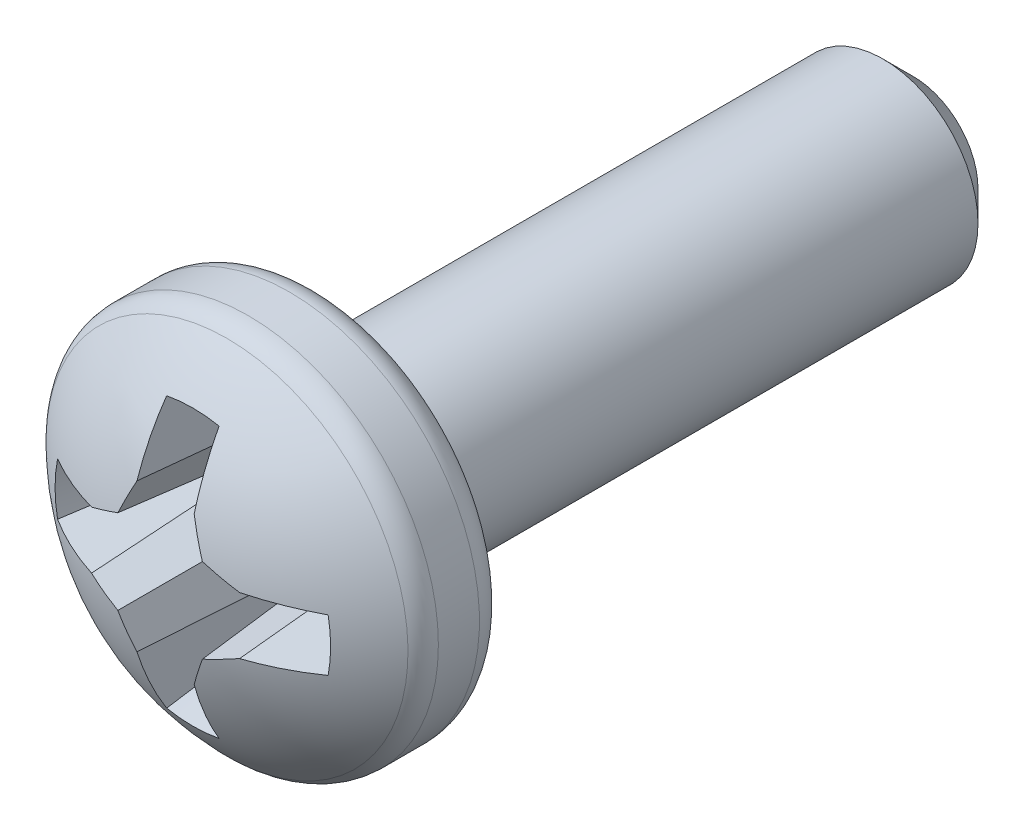
ISO-10303-21;
HEADER;
FILE_DESCRIPTION(('STEP AP214'),'2;1');
FILE_NAME('part.step','',(''),(''),'','','');
FILE_SCHEMA(('AUTOMOTIVE_DESIGN { 1 0 10303 214 1 1 1 1 }'));
ENDSEC;
DATA;
#1=APPLICATION_CONTEXT('core data for automotive mechanical design processes');
#2=APPLICATION_PROTOCOL_DEFINITION('international standard','automotive_design',2000,#1);
#3=PRODUCT_CONTEXT('',#1,'mechanical');
#4=PRODUCT('Part','Part','',(#3));
#5=PRODUCT_RELATED_PRODUCT_CATEGORY('part','',(#4));
#6=PRODUCT_DEFINITION_FORMATION('','',#4);
#7=PRODUCT_DEFINITION_CONTEXT('part definition',#1,'design');
#8=PRODUCT_DEFINITION('design','',#6,#7);
#9=PRODUCT_DEFINITION_SHAPE('','',#8);
#10=(LENGTH_UNIT() NAMED_UNIT(*) SI_UNIT(.MILLI.,.METRE.));
#11=(NAMED_UNIT(*) PLANE_ANGLE_UNIT() SI_UNIT($,.RADIAN.));
#12=(NAMED_UNIT(*) SI_UNIT($,.STERADIAN.) SOLID_ANGLE_UNIT());
#13=UNCERTAINTY_MEASURE_WITH_UNIT(LENGTH_MEASURE(1.E-05),#10,'distance_accuracy_value','');
#14=(GEOMETRIC_REPRESENTATION_CONTEXT(3) GLOBAL_UNCERTAINTY_ASSIGNED_CONTEXT((#13)) GLOBAL_UNIT_ASSIGNED_CONTEXT((#10,
#11,#12)) REPRESENTATION_CONTEXT('',''));
#15=CARTESIAN_POINT('',(0.,0.,0.));
#16=DIRECTION('',(0.,0.,1.));
#17=DIRECTION('',(1.,0.,0.));
#18=AXIS2_PLACEMENT_3D('',#15,#16,#17);
#19=CARTESIAN_POINT('',(-0.376721674615797,0.791461441644268,0.413196607862429));
#20=DIRECTION('',(0.,0.,1.));
#21=DIRECTION('',(1.,0.,0.));
#22=AXIS2_PLACEMENT_3D('',#19,#20,#21);
#23=PLANE('',#22);
#24=DIRECTION('',(0.382683432365081,-0.92387953251129,0.));
#25=VECTOR('',#24,1.);
#26=CARTESIAN_POINT('',(-0.363407787845929,0.796976234112247,0.413196607862429));
#27=LINE('',#26,#25);
#28=CARTESIAN_POINT('',(-0.370978033261302,0.815252423264536,0.413196607862429));
#29=VERTEX_POINT('',#28);
#30=CARTESIAN_POINT('',(-0.365692089679838,0.802491026580226,0.413196607862429));
#31=VERTEX_POINT('',#30);
#32=EDGE_CURVE('E292',#29,#31,#27,.T.);
#33=ORIENTED_EDGE('',*,*,#32,.F.);
#34=DIRECTION('',(0.,1.,0.));
#35=VECTOR('',#34,1.);
#36=CARTESIAN_POINT('',(-0.370978033261302,0.791461441644268,0.413196607862429));
#37=LINE('',#36,#35);
#38=CARTESIAN_POINT('',(-0.370978033261302,0.827667770301122,0.413196607862429));
#39=VERTEX_POINT('',#38);
#40=EDGE_CURVE('E168',#39,#29,#37,.F.);
#41=ORIENTED_EDGE('',*,*,#40,.F.);
#42=CARTESIAN_POINT('',(-0.376721674615797,0.791461441644268,0.413196607862429));
#43=DIRECTION('',(0.,0.,1.));
#44=DIRECTION('',(1.,0.,0.));
#45=AXIS2_PLACEMENT_3D('',#42,#43,#44);
#46=CIRCLE('',#45,0.0366590732400206);
#47=CARTESIAN_POINT('',(-0.382465315970288,0.827667770301123,0.413196607862429));
#48=VERTEX_POINT('',#47);
#49=EDGE_CURVE('E159',#39,#48,#46,.T.);
#50=ORIENTED_EDGE('',*,*,#49,.T.);
#51=DIRECTION('',(0.,1.,0.));
#52=VECTOR('',#51,1.);
#53=CARTESIAN_POINT('',(-0.382465315970287,0.791461441644271,0.413196607862429));
#54=LINE('',#53,#52);
#55=CARTESIAN_POINT('',(-0.382465315970288,0.815252423264539,0.413196607862429));
#56=VERTEX_POINT('',#55);
#57=EDGE_CURVE('E166',#56,#48,#54,.T.);
#58=ORIENTED_EDGE('',*,*,#57,.F.);
#59=DIRECTION('',(0.382683432365079,0.923879532511291,0.));
#60=VECTOR('',#59,1.);
#61=CARTESIAN_POINT('',(-0.390035561385662,0.79697623411225,0.413196607862429));
#62=LINE('',#61,#60);
#63=CARTESIAN_POINT('',(-0.387751259551752,0.802491026580229,0.413196607862429));
#64=VERTEX_POINT('',#63);
#65=EDGE_CURVE('E301',#64,#56,#62,.T.);
#66=ORIENTED_EDGE('',*,*,#65,.F.);
#67=DIRECTION('',(0.923879532511289,0.382683432365086,0.));
#68=VECTOR('',#67,1.);
#69=CARTESIAN_POINT('',(-0.382236467083772,0.804775328414139,0.413196607862429));
#70=LINE('',#69,#68);
#71=CARTESIAN_POINT('',(-0.400512656236062,0.797205082998765,0.413196607862429));
#72=VERTEX_POINT('',#71);
#73=EDGE_CURVE('E307',#72,#64,#70,.T.);
#74=ORIENTED_EDGE('',*,*,#73,.F.);
#75=DIRECTION('',(1.,0.,0.));
#76=VECTOR('',#75,1.);
#77=CARTESIAN_POINT('',(-0.376721674615793,0.797205082998765,0.413196607862429));
#78=LINE('',#77,#76);
#79=CARTESIAN_POINT('',(-0.412928003323473,0.797205082997996,0.413196607853642));
#80=VERTEX_POINT('',#79);
#81=EDGE_CURVE('E313',#80,#72,#78,.T.);
#82=ORIENTED_EDGE('',*,*,#81,.F.);
#83=CARTESIAN_POINT('',(-0.376721674615794,0.791461441644271,0.413196607862429));
#84=DIRECTION('',(0.,0.,1.));
#85=DIRECTION('',(1.,0.,0.));
#86=AXIS2_PLACEMENT_3D('',#83,#84,#85);
#87=CIRCLE('',#86,0.0366590732924525);
#88=CARTESIAN_POINT('',(-0.412928003325736,0.78571780028978,0.413196607862429));
#89=VERTEX_POINT('',#88);
#90=EDGE_CURVE('E410',#80,#89,#87,.T.);
#91=ORIENTED_EDGE('',*,*,#90,.T.);
#92=DIRECTION('',(1.,0.,0.));
#93=VECTOR('',#92,1.);
#94=CARTESIAN_POINT('',(-0.376721674615797,0.78571780028978,0.413196607862429));
#95=LINE('',#94,#93);
#96=CARTESIAN_POINT('',(-0.400512656236065,0.78571780028978,0.413196607862429));
#97=VERTEX_POINT('',#96);
#98=EDGE_CURVE('E247',#97,#89,#95,.F.);
#99=ORIENTED_EDGE('',*,*,#98,.F.);
#100=DIRECTION('',(-0.923879532511292,0.382683432365076,0.));
#101=VECTOR('',#100,1.);
#102=CARTESIAN_POINT('',(-0.382236467083776,0.778147554874406,0.413196607862429));
#103=LINE('',#102,#101);
#104=CARTESIAN_POINT('',(-0.387751259551755,0.780431856708316,0.413196607862429));
#105=VERTEX_POINT('',#104);
#106=EDGE_CURVE('E248',#105,#97,#103,.T.);
#107=ORIENTED_EDGE('',*,*,#106,.F.);
#108=DIRECTION('',(-0.38268343236509,0.923879532511287,0.));
#109=VECTOR('',#108,1.);
#110=CARTESIAN_POINT('',(-0.390035561385666,0.785946649176296,0.413196607862429));
#111=LINE('',#110,#109);
#112=CARTESIAN_POINT('',(-0.382465315970291,0.767670460024005,0.413196607862429));
#113=VERTEX_POINT('',#112);
#114=EDGE_CURVE('E254',#113,#105,#111,.T.);
#115=ORIENTED_EDGE('',*,*,#114,.F.);
#116=DIRECTION('',(0.,1.,0.));
#117=VECTOR('',#116,1.);
#118=CARTESIAN_POINT('',(-0.382465315970291,0.791461441644275,0.413196607862429));
#119=LINE('',#118,#117);
#120=CARTESIAN_POINT('',(-0.38246531597029,0.755255112943223,0.413196607862429));
#121=VERTEX_POINT('',#120);
#122=EDGE_CURVE('E260',#121,#113,#119,.T.);
#123=ORIENTED_EDGE('',*,*,#122,.F.);
#124=CARTESIAN_POINT('',(-0.376721674615796,0.791461441644275,0.413196607862429));
#125=DIRECTION('',(0.,0.,1.));
#126=DIRECTION('',(1.,0.,0.));
#127=AXIS2_PLACEMENT_3D('',#124,#125,#126);
#128=CIRCLE('',#127,0.036659073283672);
#129=CARTESIAN_POINT('',(-0.370978033261305,0.755255112943223,0.413196607862429));
#130=VERTEX_POINT('',#129);
#131=EDGE_CURVE('E336',#121,#130,#128,.T.);
#132=ORIENTED_EDGE('',*,*,#131,.T.);
#133=DIRECTION('',(0.,1.,0.));
#134=VECTOR('',#133,1.);
#135=CARTESIAN_POINT('',(-0.370978033261306,0.791461441644272,0.413196607862429));
#136=LINE('',#135,#134);
#137=CARTESIAN_POINT('',(-0.370978033261305,0.767670460024002,0.413196607862429));
#138=VERTEX_POINT('',#137);
#139=EDGE_CURVE('E266',#138,#130,#136,.F.);
#140=ORIENTED_EDGE('',*,*,#139,.F.);
#141=DIRECTION('',(-0.382683432365075,-0.923879532511293,0.));
#142=VECTOR('',#141,1.);
#143=CARTESIAN_POINT('',(-0.363407787845931,0.785946649176293,0.413196607862429));
#144=LINE('',#143,#142);
#145=CARTESIAN_POINT('',(-0.365692089679841,0.780431856708313,0.413196607862429));
#146=VERTEX_POINT('',#145);
#147=EDGE_CURVE('E267',#146,#138,#144,.T.);
#148=ORIENTED_EDGE('',*,*,#147,.F.);
#149=DIRECTION('',(-0.923879532511286,-0.382683432365092,0.));
#150=VECTOR('',#149,1.);
#151=CARTESIAN_POINT('',(-0.371206882147821,0.778147554874402,0.413196607862429));
#152=LINE('',#151,#150);
#153=CARTESIAN_POINT('',(-0.352930692995531,0.785717800289777,0.413196607862429));
#154=VERTEX_POINT('',#153);
#155=EDGE_CURVE('E273',#154,#146,#152,.T.);
#156=ORIENTED_EDGE('',*,*,#155,.F.);
#157=DIRECTION('',(1.,0.,0.));
#158=VECTOR('',#157,1.);
#159=CARTESIAN_POINT('',(-0.3767216746158,0.785717800289777,0.413196607862429));
#160=LINE('',#159,#158);
#161=CARTESIAN_POINT('',(-0.340515345958942,0.785717800289777,0.413196607862429));
#162=VERTEX_POINT('',#161);
#163=EDGE_CURVE('E279',#162,#154,#160,.F.);
#164=ORIENTED_EDGE('',*,*,#163,.F.);
#165=CARTESIAN_POINT('',(-0.376721674615797,0.791461441644268,0.413196607862429));
#166=DIRECTION('',(0.,0.,1.));
#167=DIRECTION('',(1.,0.,0.));
#168=AXIS2_PLACEMENT_3D('',#165,#166,#167);
#169=CIRCLE('',#168,0.0366590732400206);
#170=CARTESIAN_POINT('',(-0.340515345958943,0.797205082998762,0.413196607862429));
#171=VERTEX_POINT('',#170);
#172=EDGE_CURVE('E492',#162,#171,#169,.T.);
#173=ORIENTED_EDGE('',*,*,#172,.T.);
#174=DIRECTION('',(1.,0.,0.));
#175=VECTOR('',#174,1.);
#176=CARTESIAN_POINT('',(-0.376721674615797,0.797205082998762,0.413196607862429));
#177=LINE('',#176,#175);
#178=CARTESIAN_POINT('',(-0.352930692995528,0.797205082998762,0.413196607862429));
#179=VERTEX_POINT('',#178);
#180=EDGE_CURVE('E285',#179,#171,#177,.T.);
#181=ORIENTED_EDGE('',*,*,#180,.F.);
#182=DIRECTION('',(0.92387953251129,-0.382683432365083,0.));
#183=VECTOR('',#182,1.);
#184=CARTESIAN_POINT('',(-0.371206882147818,0.804775328414136,0.413196607862429));
#185=LINE('',#184,#183);
#186=EDGE_CURVE('E286',#31,#179,#185,.T.);
#187=ORIENTED_EDGE('',*,*,#186,.F.);
#188=EDGE_LOOP('',(#33,#41,#50,#58,#66,#74,#82,#91,#99,#107,#115,#123,#132,#140,#148,#156,#164,
#173,#181,#187));
#189=FACE_BOUND('',#188,.T.);
#190=ADVANCED_FACE('F17',(#189),#23,.T.);
#191=CARTESIAN_POINT('',(-0.376721674615793,0.801303961329311,0.460047001563216));
#192=DIRECTION('',(0.,-0.996194698091744,0.0871557427476727));
#193=DIRECTION('',(0.,-0.0871557427476727,-0.996194698091744));
#194=AXIS2_PLACEMENT_3D('',#191,#192,#193);
#195=PLANE('',#194);
#196=DIRECTION('',(0.0173337504938649,-0.0871426484044457,-0.996045029063885));
#197=VECTOR('',#196,1.);
#198=CARTESIAN_POINT('',(-0.401256056740422,0.8009424097128,0.455914447676356));
#199=LINE('',#198,#197);
#200=CARTESIAN_POINT('',(-0.401256056740422,0.8009424097128,0.455914447676356));
#201=VERTEX_POINT('',#200);
#202=EDGE_CURVE('E310',#201,#72,#199,.T.);
#203=ORIENTED_EDGE('',*,*,#202,.F.);
#204=CARTESIAN_POINT('',(-0.4215693076876,0.80015108887588,0.446869609122098));
#205=CARTESIAN_POINT('',(-0.418380948004435,0.800321424804083,0.448816557690383));
#206=CARTESIAN_POINT('',(-0.415093997250593,0.800472536171256,0.450543768520713));
#207=CARTESIAN_POINT('',(-0.408322913601555,0.800736309783544,0.453558714705461));
#208=CARTESIAN_POINT('',(-0.404838780706359,0.800848972028658,0.45484645005988));
#209=CARTESIAN_POINT('',(-0.401256056740486,0.800942409712743,0.455914447676343));
#210=B_SPLINE_CURVE_WITH_KNOTS('',3,(#204,#205,#206,#207,#208,#209),.UNSPECIFIED.,.F.,.F.,(4,2,
4),(0.,0.0111485978671279,0.0222971957342559),.UNSPECIFIED.);
#211=CARTESIAN_POINT('',(-0.421569307677023,0.800151088874493,0.446869609106245));
#212=VERTEX_POINT('',#211);
#213=EDGE_CURVE('E409',#212,#201,#210,.T.);
#214=ORIENTED_EDGE('',*,*,#213,.F.);
#215=CARTESIAN_POINT('',(-0.421569307666445,0.800151088873107,0.446869609090391));
#216=CARTESIAN_POINT('',(-0.420132839888683,0.79966000435443,0.441256487356838));
#217=CARTESIAN_POINT('',(-0.418694497313129,0.799168961608414,0.435643843086986));
#218=CARTESIAN_POINT('',(-0.415814062531475,0.798186959649785,0.424419509338453));
#219=CARTESIAN_POINT('',(-0.414371970325285,0.797696000437175,0.418807819859794));
#220=CARTESIAN_POINT('',(-0.412928003321212,0.797205082997228,0.413196607844861));
#221=B_SPLINE_CURVE_WITH_KNOTS('',3,(#215,#216,#217,#218,#219,#220),.UNSPECIFIED.,.F.,.F.,(4,2,
4),(0.,0.0174443558891328,0.034888712201716),.UNSPECIFIED.);
#222=EDGE_CURVE('E318',#212,#80,#221,.T.);
#223=ORIENTED_EDGE('',*,*,#222,.T.);
#224=ORIENTED_EDGE('',*,*,#81,.T.);
#225=EDGE_LOOP('',(#203,#214,#223,#224));
#226=FACE_BOUND('',#225,.T.);
#227=ADVANCED_FACE('F427',(#226),#195,.T.);
#228=CARTESIAN_POINT('',(-0.383805039912152,0.808562198209984,0.460047001563216));
#229=DIRECTION('',(0.381227206369649,-0.920363891963225,0.0871557427476661));
#230=DIRECTION('',(0.923879532511289,0.382683432365086,0.));
#231=AXIS2_PLACEMENT_3D('',#228,#229,#230);
#232=PLANE('',#231);
#233=DIRECTION('',(0.0666626913468198,-0.0666626913468417,-0.995546167269401));
#234=VECTOR('',#233,1.);
#235=CARTESIAN_POINT('',(-0.390733038303313,0.805472805331791,0.457726739301586));
#236=LINE('',#235,#234);
#237=CARTESIAN_POINT('',(-0.390733038303313,0.805472805331791,0.457726739301586));
#238=VERTEX_POINT('',#237);
#239=EDGE_CURVE('E304',#238,#64,#236,.T.);
#240=ORIENTED_EDGE('',*,*,#239,.F.);
#241=CARTESIAN_POINT('',(-0.401256056740422,0.8009424097128,0.455914447676356));
#242=CARTESIAN_POINT('',(-0.399525687185487,0.801700049456702,0.456346321822599));
#243=CARTESIAN_POINT('',(-0.397783584204927,0.802456402296903,0.456713283197823));
#244=CARTESIAN_POINT('',(-0.394275911392557,0.8039665341699,0.457317380406233));
#245=CARTESIAN_POINT('',(-0.392510341560748,0.804720313202696,0.457554516239419));
#246=CARTESIAN_POINT('',(-0.390733038303313,0.805472805331791,0.457726739301586));
#247=B_SPLINE_CURVE_WITH_KNOTS('',3,(#241,#242,#243,#244,#245,#246),.UNSPECIFIED.,.F.,.F.,(4,2,
4),(0.,0.00580300590917776,0.0116060118183554),.UNSPECIFIED.);
#248=EDGE_CURVE('E439',#201,#238,#247,.T.);
#249=ORIENTED_EDGE('',*,*,#248,.F.);
#250=ORIENTED_EDGE('',*,*,#202,.T.);
#251=ORIENTED_EDGE('',*,*,#73,.T.);
#252=EDGE_LOOP('',(#240,#249,#250,#251));
#253=FACE_BOUND('',#252,.T.);
#254=ADVANCED_FACE('F431',(#253),#232,.T.);
#255=CARTESIAN_POINT('',(-0.393822431181506,0.79854480694063,0.460047001563216));
#256=DIRECTION('',(0.920363891963229,-0.381227206369643,0.0871557427476506));
#257=DIRECTION('',(0.382683432365079,0.923879532511291,0.));
#258=AXIS2_PLACEMENT_3D('',#255,#256,#257);
#259=PLANE('',#258);
#260=DIRECTION('',(0.0871426484044251,-0.0173337504938855,-0.996045029063886));
#261=VECTOR('',#260,1.);
#262=CARTESIAN_POINT('',(-0.386202642684322,0.8159958237689,0.455914447676355));
#263=LINE('',#262,#261);
#264=CARTESIAN_POINT('',(-0.386202642684322,0.8159958237689,0.455914447676355));
#265=VERTEX_POINT('',#264);
#266=EDGE_CURVE('E176',#265,#56,#263,.T.);
#267=ORIENTED_EDGE('',*,*,#266,.F.);
#268=CARTESIAN_POINT('',(-0.390733038303313,0.805472805331791,0.457726739301586));
#269=CARTESIAN_POINT('',(-0.389980546174219,0.807250108589226,0.457554516239419));
#270=CARTESIAN_POINT('',(-0.389226767141422,0.809015678421036,0.457317380406232));
#271=CARTESIAN_POINT('',(-0.387716635268425,0.812523351233405,0.456713283197822));
#272=CARTESIAN_POINT('',(-0.386960282428225,0.814265454213965,0.456346321822598));
#273=CARTESIAN_POINT('',(-0.386202642684322,0.8159958237689,0.455914447676355));
#274=B_SPLINE_CURVE_WITH_KNOTS('',3,(#268,#269,#270,#271,#272,#273),.UNSPECIFIED.,.F.,.F.,(4,2,
4),(0.,0.00580300590917782,0.0116060118183555),.UNSPECIFIED.);
#275=EDGE_CURVE('E445',#238,#265,#274,.T.);
#276=ORIENTED_EDGE('',*,*,#275,.F.);
#277=ORIENTED_EDGE('',*,*,#239,.T.);
#278=ORIENTED_EDGE('',*,*,#65,.T.);
#279=EDGE_LOOP('',(#267,#276,#277,#278));
#280=FACE_BOUND('',#279,.T.);
#281=ADVANCED_FACE('F436',(#280),#259,.T.);
#282=CARTESIAN_POINT('',(-0.386564194300832,0.791461441644271,0.460047001563216));
#283=DIRECTION('',(0.996194698091747,0.,0.0871557427476441));
#284=DIRECTION('',(0.0871557427476441,0.,-0.996194698091747));
#285=AXIS2_PLACEMENT_3D('',#282,#283,#284);
#286=PLANE('',#285);
#287=CARTESIAN_POINT('',(-0.382465315975502,0.82766777030939,0.413196607882709));
#288=CARTESIAN_POINT('',(-0.382956233413623,0.829111737318924,0.418807819896428));
#289=CARTESIAN_POINT('',(-0.383447192624965,0.830553829531065,0.4244195093737));
#290=CARTESIAN_POINT('',(-0.384429194582173,0.833434264325601,0.435643843119115));
#291=CARTESIAN_POINT('',(-0.384920237328038,0.834872606908087,0.441256487387236));
#292=CARTESIAN_POINT('',(-0.385411321847121,0.836309074693272,0.446869609118886));
#293=B_SPLINE_CURVE_WITH_KNOTS('',3,(#287,#288,#289,#290,#291,#292),.UNSPECIFIED.,.F.,.F.,(4,2,
4),(0.,0.0174443563126749,0.0348887122019007),.UNSPECIFIED.);
#294=CARTESIAN_POINT('',(-0.385411321846587,0.836309074691708,0.446869609112778));
#295=VERTEX_POINT('',#294);
#296=EDGE_CURVE('E170',#48,#295,#293,.T.);
#297=ORIENTED_EDGE('',*,*,#296,.T.);
#298=CARTESIAN_POINT('',(-0.386202642684322,0.8159958237689,0.455914447676355));
#299=CARTESIAN_POINT('',(-0.386109205000266,0.819578547732584,0.454846450060554));
#300=CARTESIAN_POINT('',(-0.385996542755213,0.823062680625728,0.453558714707054));
#301=CARTESIAN_POINT('',(-0.385732769143114,0.829833764270935,0.450543768524655));
#302=CARTESIAN_POINT('',(-0.385581657776068,0.833120715022998,0.448816557695757));
#303=CARTESIAN_POINT('',(-0.385411321848025,0.836309074704521,0.44686960912916));
#304=B_SPLINE_CURVE_WITH_KNOTS('',3,(#298,#299,#300,#301,#302,#303),.UNSPECIFIED.,.F.,.F.,(4,2,
4),(0.,0.0111485978603956,0.022297195720791),.UNSPECIFIED.);
#305=EDGE_CURVE('E450',#265,#295,#304,.T.);
#306=ORIENTED_EDGE('',*,*,#305,.F.);
#307=ORIENTED_EDGE('',*,*,#266,.T.);
#308=ORIENTED_EDGE('',*,*,#57,.T.);
#309=EDGE_LOOP('',(#297,#306,#307,#308));
#310=FACE_BOUND('',#309,.T.);
#311=ADVANCED_FACE('F173',(#310),#286,.T.);
#312=CARTESIAN_POINT('',(-0.376721674615797,0.791461441644268,0.44686960910667));
#313=DIRECTION('',(0.,0.,1.));
#314=DIRECTION('',(0.,-1.,0.));
#315=AXIS2_PLACEMENT_3D('',#312,#313,#314);
#316=CONICAL_SURFACE('',#315,0.0456817267493676,0.261799388331704);
#317=ORIENTED_EDGE('',*,*,#296,.F.);
#318=ORIENTED_EDGE('',*,*,#49,.F.);
#319=CARTESIAN_POINT('',(-0.368032027383754,0.83630907469536,0.44686960912705));
#320=CARTESIAN_POINT('',(-0.368523111902537,0.834872606909888,0.441256487392284));
#321=CARTESIAN_POINT('',(-0.369014154648659,0.833434264326647,0.435643843121215));
#322=CARTESIAN_POINT('',(-0.369996156607501,0.830553829529668,0.424419509370241));
#323=CARTESIAN_POINT('',(-0.370487115820218,0.829111737315839,0.418807819890358));
#324=CARTESIAN_POINT('',(-0.370978033260273,0.827667770304151,0.413196607874197));
#325=B_SPLINE_CURVE_WITH_KNOTS('',3,(#319,#320,#321,#322,#323,#324),.UNSPECIFIED.,.F.,.F.,(4,2,
4),(0.,0.0174443558983872,0.0348887122202246),.UNSPECIFIED.);
#326=CARTESIAN_POINT('',(-0.368032027383636,0.836309074699466,0.446869609128395));
#327=VERTEX_POINT('',#326);
#328=EDGE_CURVE('E182',#327,#39,#325,.T.);
#329=ORIENTED_EDGE('',*,*,#328,.F.);
#330=CARTESIAN_POINT('',(-0.376721674615797,0.791461441644268,0.44686960910667));
#331=DIRECTION('',(0.,0.,1.));
#332=DIRECTION('',(0.,-1.,0.));
#333=AXIS2_PLACEMENT_3D('',#330,#331,#332);
#334=CIRCLE('',#333,0.0456817267493676);
#335=EDGE_CURVE('E180',#295,#327,#334,.F.);
#336=ORIENTED_EDGE('',*,*,#335,.F.);
#337=EDGE_LOOP('',(#317,#318,#329,#336));
#338=FACE_BOUND('',#337,.T.);
#339=ADVANCED_FACE('F178',(#338),#316,.F.);
#340=CARTESIAN_POINT('',(-0.366879154930757,0.791461441644268,0.460047001563216));
#341=DIRECTION('',(-0.996194698091746,0.,0.0871557427476584));
#342=DIRECTION('',(0.0871557427476584,0.,0.996194698091746));
#343=AXIS2_PLACEMENT_3D('',#340,#341,#342);
#344=PLANE('',#343);
#345=DIRECTION('',(-0.087142648404438,-0.0173337504938649,-0.996045029063886));
#346=VECTOR('',#345,1.);
#347=CARTESIAN_POINT('',(-0.367240706547268,0.815995823768896,0.455914447676356));
#348=LINE('',#347,#346);
#349=CARTESIAN_POINT('',(-0.367240706547268,0.815995823768896,0.455914447676356));
#350=VERTEX_POINT('',#349);
#351=EDGE_CURVE('E295',#350,#29,#348,.T.);
#352=ORIENTED_EDGE('',*,*,#351,.F.);
#353=CARTESIAN_POINT('',(-0.368032027383518,0.836309074703571,0.446869609129741));
#354=CARTESIAN_POINT('',(-0.367861691455486,0.833120715022186,0.448816557696197));
#355=CARTESIAN_POINT('',(-0.367710580088449,0.829833764270271,0.450543768524976));
#356=CARTESIAN_POINT('',(-0.367446806476364,0.823062680625384,0.45355871470718));
#357=CARTESIAN_POINT('',(-0.367334144231316,0.819578547732412,0.454846450060604));
#358=CARTESIAN_POINT('',(-0.367240706547262,0.81599582376891,0.45591444767635));
#359=B_SPLINE_CURVE_WITH_KNOTS('',3,(#353,#354,#355,#356,#357,#358),.UNSPECIFIED.,.F.,.F.,(4,2,
4),(0.,0.0111485978598342,0.0222971957196683),.UNSPECIFIED.);
#360=EDGE_CURVE('E210',#327,#350,#359,.T.);
#361=ORIENTED_EDGE('',*,*,#360,.F.);
#362=ORIENTED_EDGE('',*,*,#328,.T.);
#363=ORIENTED_EDGE('',*,*,#40,.T.);
#364=EDGE_LOOP('',(#352,#361,#362,#363));
#365=FACE_BOUND('',#364,.T.);
#366=ADVANCED_FACE('F199',(#365),#344,.T.);
#367=CARTESIAN_POINT('',(-0.359620918050084,0.798544806940627,0.460047001563216));
#368=DIRECTION('',(-0.920363891963228,-0.381227206369645,0.0871557427476584));
#369=DIRECTION('',(0.382683432365081,-0.92387953251129,0.));
#370=AXIS2_PLACEMENT_3D('',#367,#368,#369);
#371=PLANE('',#370);
#372=DIRECTION('',(-0.0666626913468198,-0.0666626913468417,-0.995546167269401));
#373=VECTOR('',#372,1.);
#374=CARTESIAN_POINT('',(-0.362710310928277,0.805472805331788,0.457726739301586));
#375=LINE('',#374,#373);
#376=CARTESIAN_POINT('',(-0.362710310928277,0.805472805331788,0.457726739301586));
#377=VERTEX_POINT('',#376);
#378=EDGE_CURVE('E289',#377,#31,#375,.T.);
#379=ORIENTED_EDGE('',*,*,#378,.F.);
#380=CARTESIAN_POINT('',(-0.367240706547268,0.815995823768896,0.455914447676356));
#381=CARTESIAN_POINT('',(-0.366483066803365,0.814265454213961,0.456346321822598));
#382=CARTESIAN_POINT('',(-0.365726713963165,0.812523351233401,0.456713283197823));
#383=CARTESIAN_POINT('',(-0.364216582090168,0.809015678421032,0.457317380406233));
#384=CARTESIAN_POINT('',(-0.363462803057372,0.807250108589223,0.457554516239419));
#385=CARTESIAN_POINT('',(-0.362710310928277,0.805472805331788,0.457726739301586));
#386=B_SPLINE_CURVE_WITH_KNOTS('',3,(#380,#381,#382,#383,#384,#385),.UNSPECIFIED.,.F.,.F.,(4,2,
4),(0.,0.00580300590917694,0.0116060118183539),.UNSPECIFIED.);
#387=EDGE_CURVE('E218',#350,#377,#386,.T.);
#388=ORIENTED_EDGE('',*,*,#387,.F.);
#389=ORIENTED_EDGE('',*,*,#351,.T.);
#390=ORIENTED_EDGE('',*,*,#32,.T.);
#391=EDGE_LOOP('',(#379,#388,#389,#390));
#392=FACE_BOUND('',#391,.T.);
#393=ADVANCED_FACE('F204',(#392),#371,.T.);
#394=CARTESIAN_POINT('',(-0.369638309319438,0.808562198209981,0.460047001563216));
#395=DIRECTION('',(-0.381227206369647,-0.920363891963227,0.0871557427476583));
#396=DIRECTION('',(0.92387953251129,-0.382683432365083,0.));
#397=AXIS2_PLACEMENT_3D('',#394,#395,#396);
#398=PLANE('',#397);
#399=DIRECTION('',(-0.0173337504938611,-0.0871426484044405,-0.996045029063885));
#400=VECTOR('',#399,1.);
#401=CARTESIAN_POINT('',(-0.352187292491168,0.800942409712797,0.455914447676356));
#402=LINE('',#401,#400);
#403=CARTESIAN_POINT('',(-0.352187292491168,0.800942409712797,0.455914447676356));
#404=VERTEX_POINT('',#403);
#405=EDGE_CURVE('E282',#404,#179,#402,.T.);
#406=ORIENTED_EDGE('',*,*,#405,.F.);
#407=CARTESIAN_POINT('',(-0.362710310928277,0.805472805331788,0.457726739301586));
#408=CARTESIAN_POINT('',(-0.360933007670842,0.804720313202693,0.457554516239419));
#409=CARTESIAN_POINT('',(-0.359167437839033,0.803966534169897,0.457317380406233));
#410=CARTESIAN_POINT('',(-0.355659765026663,0.8024564022969,0.456713283197822));
#411=CARTESIAN_POINT('',(-0.353917662046103,0.801700049456699,0.456346321822598));
#412=CARTESIAN_POINT('',(-0.352187292491168,0.800942409712797,0.455914447676355));
#413=B_SPLINE_CURVE_WITH_KNOTS('',3,(#407,#408,#409,#410,#411,#412),.UNSPECIFIED.,.F.,.F.,(4,2,
4),(0.,0.0058030059091778,0.0116060118183555),.UNSPECIFIED.);
#414=EDGE_CURVE('E462',#377,#404,#413,.T.);
#415=ORIENTED_EDGE('',*,*,#414,.F.);
#416=ORIENTED_EDGE('',*,*,#378,.T.);
#417=ORIENTED_EDGE('',*,*,#186,.T.);
#418=EDGE_LOOP('',(#406,#415,#416,#417));
#419=FACE_BOUND('',#418,.T.);
#420=ADVANCED_FACE('F474',(#419),#398,.T.);
#421=CARTESIAN_POINT('',(-0.376721674615797,0.801303961329307,0.460047001563216));
#422=DIRECTION('',(0.,-0.996194698091746,0.0871557427476584));
#423=DIRECTION('',(0.,-0.0871557427476584,-0.996194698091746));
#424=AXIS2_PLACEMENT_3D('',#421,#422,#423);
#425=PLANE('',#424);
#426=CARTESIAN_POINT('',(-0.340515345953711,0.79720508300054,0.413196607882751));
#427=CARTESIAN_POINT('',(-0.339071378942742,0.797696000440351,0.418807819896127));
#428=CARTESIAN_POINT('',(-0.337629286729631,0.798186959652824,0.424419509373224));
#429=CARTESIAN_POINT('',(-0.334748851934083,0.799168961611178,0.435643843118625));
#430=CARTESIAN_POINT('',(-0.333310509351555,0.799660004357057,0.441256487386907));
#431=CARTESIAN_POINT('',(-0.331874041566794,0.800151088875596,0.446869609118886));
#432=B_SPLINE_CURVE_WITH_KNOTS('',3,(#426,#427,#428,#429,#430,#431),.UNSPECIFIED.,.F.,.F.,(4,2,
4),(0.,0.0174443563131765,0.0348887122029026),.UNSPECIFIED.);
#433=CARTESIAN_POINT('',(-0.331874041568358,0.800151088875062,0.446869609112778));
#434=VERTEX_POINT('',#433);
#435=EDGE_CURVE('E351',#171,#434,#432,.T.);
#436=ORIENTED_EDGE('',*,*,#435,.T.);
#437=CARTESIAN_POINT('',(-0.352187292491168,0.800942409712797,0.455914447676355));
#438=CARTESIAN_POINT('',(-0.348604568527471,0.800848972028759,0.454846450060548));
#439=CARTESIAN_POINT('',(-0.345120435634315,0.800736309783706,0.453558714707043));
#440=CARTESIAN_POINT('',(-0.338349351989085,0.800472536171568,0.450543768524635));
#441=CARTESIAN_POINT('',(-0.335062401237011,0.800321424804482,0.448816557695733));
#442=CARTESIAN_POINT('',(-0.331874041555478,0.800151088876381,0.446869609129133));
#443=B_SPLINE_CURVE_WITH_KNOTS('',3,(#437,#438,#439,#440,#441,#442),.UNSPECIFIED.,.F.,.F.,(4,2,
4),(0.,0.011148597860435,0.02229719572087),.UNSPECIFIED.);
#444=EDGE_CURVE('E463',#404,#434,#443,.T.);
#445=ORIENTED_EDGE('',*,*,#444,.F.);
#446=ORIENTED_EDGE('',*,*,#405,.T.);
#447=ORIENTED_EDGE('',*,*,#180,.T.);
#448=EDGE_LOOP('',(#436,#445,#446,#447));
#449=FACE_BOUND('',#448,.T.);
#450=ADVANCED_FACE('F477',(#449),#425,.T.);
#451=CARTESIAN_POINT('',(-0.376721674615797,0.791461441644268,0.44686960910667));
#452=DIRECTION('',(0.,0.,1.));
#453=DIRECTION('',(0.,-1.,0.));
#454=AXIS2_PLACEMENT_3D('',#451,#452,#453);
#455=CONICAL_SURFACE('',#454,0.0456817267493676,0.261799388331704);
#456=ORIENTED_EDGE('',*,*,#172,.F.);
#457=CARTESIAN_POINT('',(-0.331874041564704,0.782771794412229,0.44686960912705));
#458=CARTESIAN_POINT('',(-0.333310509350218,0.783262878931026,0.441256487392122));
#459=CARTESIAN_POINT('',(-0.3347488519335,0.783753921677162,0.435643843120893));
#460=CARTESIAN_POINT('',(-0.337629286730561,0.784735923636032,0.424419509369597));
#461=CARTESIAN_POINT('',(-0.339071378944432,0.785226882848763,0.418807819889553));
#462=CARTESIAN_POINT('',(-0.340515345956162,0.785717800288832,0.413196607873231));
#463=B_SPLINE_CURVE_WITH_KNOTS('',3,(#457,#458,#459,#460,#461,#462),.UNSPECIFIED.,.F.,.F.,(4,2,
4),(0.,0.0174443558988876,0.0348887122212254),.UNSPECIFIED.);
#464=CARTESIAN_POINT('',(-0.331874041560598,0.782771794412111,0.446869609128395));
#465=VERTEX_POINT('',#464);
#466=EDGE_CURVE('E346',#465,#162,#463,.T.);
#467=ORIENTED_EDGE('',*,*,#466,.F.);
#468=CARTESIAN_POINT('',(-0.376721674615797,0.791461441644268,0.44686960910667));
#469=DIRECTION('',(0.,0.,1.));
#470=DIRECTION('',(0.,-1.,0.));
#471=AXIS2_PLACEMENT_3D('',#468,#469,#470);
#472=CIRCLE('',#471,0.0456817267493676);
#473=EDGE_CURVE('E464',#434,#465,#472,.F.);
#474=ORIENTED_EDGE('',*,*,#473,.F.);
#475=ORIENTED_EDGE('',*,*,#435,.F.);
#476=EDGE_LOOP('',(#456,#467,#474,#475));
#477=FACE_BOUND('',#476,.T.);
#478=ADVANCED_FACE('F482',(#477),#455,.F.);
#479=CARTESIAN_POINT('',(-0.3767216746158,0.781618921959232,0.460047001563216));
#480=DIRECTION('',(0.,0.996194698091747,0.0871557427476441));
#481=DIRECTION('',(0.,-0.0871557427476441,0.996194698091747));
#482=AXIS2_PLACEMENT_3D('',#479,#480,#481);
#483=PLANE('',#482);
#484=DIRECTION('',(-0.0173337504938405,0.0871426484044261,-0.996045029063887));
#485=VECTOR('',#484,1.);
#486=CARTESIAN_POINT('',(-0.352187292491172,0.781980473575742,0.455914447676357));
#487=LINE('',#486,#485);
#488=CARTESIAN_POINT('',(-0.352187292491172,0.781980473575742,0.455914447676357));
#489=VERTEX_POINT('',#488);
#490=EDGE_CURVE('E276',#489,#154,#487,.T.);
#491=ORIENTED_EDGE('',*,*,#490,.F.);
#492=CARTESIAN_POINT('',(-0.331874041556493,0.782771794411994,0.44686960912974));
#493=CARTESIAN_POINT('',(-0.335062401237871,0.782601458483952,0.448816557696192));
#494=CARTESIAN_POINT('',(-0.338349351989779,0.782450347116915,0.450543768524968));
#495=CARTESIAN_POINT('',(-0.345120435634651,0.78218657350485,0.453558714707169));
#496=CARTESIAN_POINT('',(-0.348604568527615,0.782073911259823,0.454846450060594));
#497=CARTESIAN_POINT('',(-0.352187292491108,0.7819804735758,0.455914447676344));
#498=B_SPLINE_CURVE_WITH_KNOTS('',3,(#492,#493,#494,#495,#496,#497),.UNSPECIFIED.,.F.,.F.,(4,2,
4),(0.,0.0111485978598109,0.0222971957196219),.UNSPECIFIED.);
#499=EDGE_CURVE('E509',#465,#489,#498,.T.);
#500=ORIENTED_EDGE('',*,*,#499,.F.);
#501=ORIENTED_EDGE('',*,*,#466,.T.);
#502=ORIENTED_EDGE('',*,*,#163,.T.);
#503=EDGE_LOOP('',(#491,#500,#501,#502));
#504=FACE_BOUND('',#503,.T.);
#505=ADVANCED_FACE('F499',(#504),#483,.T.);
#506=CARTESIAN_POINT('',(-0.369638309319441,0.774360685078558,0.460047001563216));
#507=DIRECTION('',(-0.381227206369656,0.920363891963225,0.0871557427476397));
#508=DIRECTION('',(-0.923879532511286,-0.382683432365092,0.));
#509=AXIS2_PLACEMENT_3D('',#506,#507,#508);
#510=PLANE('',#509);
#511=DIRECTION('',(-0.0666626913468194,0.0666626913468194,-0.995546167269403));
#512=VECTOR('',#511,1.);
#513=CARTESIAN_POINT('',(-0.36271031092828,0.777450077956752,0.457726739301588));
#514=LINE('',#513,#512);
#515=CARTESIAN_POINT('',(-0.36271031092828,0.777450077956752,0.457726739301588));
#516=VERTEX_POINT('',#515);
#517=EDGE_CURVE('E270',#516,#146,#514,.T.);
#518=ORIENTED_EDGE('',*,*,#517,.F.);
#519=CARTESIAN_POINT('',(-0.352187292491172,0.781980473575742,0.455914447676357));
#520=CARTESIAN_POINT('',(-0.353917662046106,0.781222833831839,0.4563463218226));
#521=CARTESIAN_POINT('',(-0.355659765026666,0.780466480991639,0.456713283197824));
#522=CARTESIAN_POINT('',(-0.359167437839035,0.778956349118642,0.457317380406234));
#523=CARTESIAN_POINT('',(-0.360933007670845,0.778202570085846,0.45755451623942));
#524=CARTESIAN_POINT('',(-0.36271031092828,0.777450077956751,0.457726739301587));
#525=B_SPLINE_CURVE_WITH_KNOTS('',3,(#519,#520,#521,#522,#523,#524),.UNSPECIFIED.,.F.,.F.,(4,2,
4),(0.,0.00580300590917721,0.0116060118183545),.UNSPECIFIED.);
#526=EDGE_CURVE('E515',#489,#516,#525,.T.);
#527=ORIENTED_EDGE('',*,*,#526,.F.);
#528=ORIENTED_EDGE('',*,*,#490,.T.);
#529=ORIENTED_EDGE('',*,*,#155,.T.);
#530=EDGE_LOOP('',(#518,#527,#528,#529));
#531=FACE_BOUND('',#530,.T.);
#532=ADVANCED_FACE('F503',(#531),#510,.T.);
#533=CARTESIAN_POINT('',(-0.359620918050087,0.784378076347913,0.460047001563216));
#534=DIRECTION('',(-0.920363891963232,0.381227206369639,0.0871557427476397));
#535=DIRECTION('',(-0.382683432365075,-0.923879532511293,0.));
#536=AXIS2_PLACEMENT_3D('',#533,#534,#535);
#537=PLANE('',#536);
#538=DIRECTION('',(-0.0871426484044246,0.0173337504938366,-0.996045029063887));
#539=VECTOR('',#538,1.);
#540=CARTESIAN_POINT('',(-0.367240706547271,0.766927059519643,0.455914447676357));
#541=LINE('',#540,#539);
#542=CARTESIAN_POINT('',(-0.367240706547271,0.766927059519643,0.455914447676357));
#543=VERTEX_POINT('',#542);
#544=EDGE_CURVE('E263',#543,#138,#541,.T.);
#545=ORIENTED_EDGE('',*,*,#544,.F.);
#546=CARTESIAN_POINT('',(-0.36271031092828,0.777450077956752,0.457726739301587));
#547=CARTESIAN_POINT('',(-0.363462803057374,0.775672774699317,0.45755451623942));
#548=CARTESIAN_POINT('',(-0.364216582090171,0.773907204867507,0.457317380406234));
#549=CARTESIAN_POINT('',(-0.365726713963168,0.770399532055138,0.456713283197824));
#550=CARTESIAN_POINT('',(-0.366483066803368,0.768657429074578,0.4563463218226));
#551=CARTESIAN_POINT('',(-0.367240706547271,0.766927059519643,0.455914447676357));
#552=B_SPLINE_CURVE_WITH_KNOTS('',3,(#546,#547,#548,#549,#550,#551),.UNSPECIFIED.,.F.,.F.,(4,2,
4),(0.,0.00580300590917772,0.0116060118183552),.UNSPECIFIED.);
#553=EDGE_CURVE('E535',#516,#543,#552,.T.);
#554=ORIENTED_EDGE('',*,*,#553,.F.);
#555=ORIENTED_EDGE('',*,*,#517,.T.);
#556=ORIENTED_EDGE('',*,*,#147,.T.);
#557=EDGE_LOOP('',(#545,#554,#555,#556));
#558=FACE_BOUND('',#557,.T.);
#559=ADVANCED_FACE('F548',(#558),#537,.T.);
#560=CARTESIAN_POINT('',(-0.366879154930761,0.791461441644272,0.460047001563216));
#561=DIRECTION('',(-0.996194698091747,0.,0.0871557427476441));
#562=DIRECTION('',(0.0871557427476441,0.,0.996194698091747));
#563=AXIS2_PLACEMENT_3D('',#560,#561,#562);
#564=PLANE('',#563);
#565=CARTESIAN_POINT('',(-0.370978033262717,0.755255112947376,0.413196607846294));
#566=CARTESIAN_POINT('',(-0.370487115822033,0.753811145934123,0.418807819869652));
#567=CARTESIAN_POINT('',(-0.369996156608686,0.752369053718738,0.424419509356732));
#568=CARTESIAN_POINT('',(-0.369014154648584,0.749488618918664,0.435643843122107));
#569=CARTESIAN_POINT('',(-0.368523111901832,0.748050276333884,0.441256487400378));
#570=CARTESIAN_POINT('',(-0.368032027382419,0.74661380854688,0.446869609142349));
#571=B_SPLINE_CURVE_WITH_KNOTS('',3,(#565,#566,#567,#568,#569,#570),.UNSPECIFIED.,.F.,.F.,(4,2,
4),(0.,0.0174443563439955,0.0348887122645408),.UNSPECIFIED.);
#572=CARTESIAN_POINT('',(-0.368032027381492,0.74661380854417,0.446869609152935));
#573=VERTEX_POINT('',#572);
#574=EDGE_CURVE('E559',#130,#573,#571,.T.);
#575=ORIENTED_EDGE('',*,*,#574,.T.);
#576=CARTESIAN_POINT('',(-0.367240706547271,0.766927059519643,0.455914447676357));
#577=CARTESIAN_POINT('',(-0.367334144231364,0.763344335554542,0.454846450060131));
#578=CARTESIAN_POINT('',(-0.367446806476469,0.75986020266007,0.45355871470604));
#579=CARTESIAN_POINT('',(-0.3677105800887,0.753089119012383,0.450543768522126));
#580=CARTESIAN_POINT('',(-0.367861691455827,0.749802168259169,0.448816557692304));
#581=CARTESIAN_POINT('',(-0.368032027383965,0.746613808576582,0.446869609124615));
#582=B_SPLINE_CURVE_WITH_KNOTS('',3,(#576,#577,#578,#579,#580,#581),.UNSPECIFIED.,.F.,.F.,(4,2,
4),(0.,0.0111485978647504,0.0222971957295008),.UNSPECIFIED.);
#583=EDGE_CURVE('E536',#543,#573,#582,.T.);
#584=ORIENTED_EDGE('',*,*,#583,.F.);
#585=ORIENTED_EDGE('',*,*,#544,.T.);
#586=ORIENTED_EDGE('',*,*,#139,.T.);
#587=EDGE_LOOP('',(#575,#584,#585,#586));
#588=FACE_BOUND('',#587,.T.);
#589=ADVANCED_FACE('F551',(#588),#564,.T.);
#590=CARTESIAN_POINT('',(-0.376721674615796,0.791461441644275,0.446869609163513));
#591=DIRECTION('',(0.,0.,1.));
#592=DIRECTION('',(1.,0.,0.));
#593=AXIS2_PLACEMENT_3D('',#590,#591,#592);
#594=CONICAL_SURFACE('',#593,0.0456817268062098,0.26179938827518);
#595=ORIENTED_EDGE('',*,*,#131,.F.);
#596=CARTESIAN_POINT('',(-0.385411321838518,0.746613808558087,0.446869609130895));
#597=CARTESIAN_POINT('',(-0.384920237324139,0.748050276340356,0.441256487391272));
#598=CARTESIAN_POINT('',(-0.384429194580851,0.74948861892166,0.435643843115809));
#599=CARTESIAN_POINT('',(-0.38344719262454,0.752369053717299,0.424419509356969));
#600=CARTESIAN_POINT('',(-0.382956233411519,0.753811145931725,0.418807819873616));
#601=CARTESIAN_POINT('',(-0.382465315969592,0.755255112945278,0.413196607854446));
#602=B_SPLINE_CURVE_WITH_KNOTS('',3,(#596,#597,#598,#599,#600,#601),.UNSPECIFIED.,.F.,.F.,(4,2,
4),(0.,0.0174443559089583,0.0348887122413647),.UNSPECIFIED.);
#603=CARTESIAN_POINT('',(-0.385411321847795,0.746613808563835,0.446869609126549));
#604=VERTEX_POINT('',#603);
#605=EDGE_CURVE('E331',#604,#121,#602,.T.);
#606=ORIENTED_EDGE('',*,*,#605,.F.);
#607=CARTESIAN_POINT('',(-0.376721674615796,0.791461441644275,0.446869609163513));
#608=DIRECTION('',(0.,0.,1.));
#609=DIRECTION('',(1.,0.,0.));
#610=AXIS2_PLACEMENT_3D('',#607,#608,#609);
#611=CIRCLE('',#610,0.0456817268062098);
#612=EDGE_CURVE('E538',#573,#604,#611,.F.);
#613=ORIENTED_EDGE('',*,*,#612,.F.);
#614=ORIENTED_EDGE('',*,*,#574,.F.);
#615=EDGE_LOOP('',(#595,#606,#613,#614));
#616=FACE_BOUND('',#615,.T.);
#617=ADVANCED_FACE('F555',(#616),#594,.F.);
#618=CARTESIAN_POINT('',(-0.386564194300836,0.791461441644275,0.460047001563216));
#619=DIRECTION('',(0.996194698091746,0.,0.0871557427476584));
#620=DIRECTION('',(0.0871557427476584,0.,-0.996194698091746));
#621=AXIS2_PLACEMENT_3D('',#618,#619,#620);
#622=PLANE('',#621);
#623=DIRECTION('',(0.0871426484044402,0.0173337504938312,-0.996045029063886));
#624=VECTOR('',#623,1.);
#625=CARTESIAN_POINT('',(-0.386202642684326,0.766927059519646,0.455914447676358));
#626=LINE('',#625,#624);
#627=CARTESIAN_POINT('',(-0.386202642684326,0.766927059519646,0.455914447676358));
#628=VERTEX_POINT('',#627);
#629=EDGE_CURVE('E257',#628,#113,#626,.T.);
#630=ORIENTED_EDGE('',*,*,#629,.F.);
#631=CARTESIAN_POINT('',(-0.385411321847656,0.746613808577151,0.446869609124963));
#632=CARTESIAN_POINT('',(-0.385581657775789,0.749802168259654,0.448816557692567));
#633=CARTESIAN_POINT('',(-0.385732769142911,0.753089119012779,0.450543768522318));
#634=CARTESIAN_POINT('',(-0.385996542755136,0.759860202660273,0.453558714706114));
#635=CARTESIAN_POINT('',(-0.386109205000238,0.763344335554641,0.45484645006016));
#636=CARTESIAN_POINT('',(-0.386202642684331,0.766927059519632,0.455914447676352));
#637=B_SPLINE_CURVE_WITH_KNOTS('',3,(#631,#632,#633,#634,#635,#636),.UNSPECIFIED.,.F.,.F.,(4,2,
4),(0.,0.0111485978644114,0.0222971957288228),.UNSPECIFIED.);
#638=EDGE_CURVE('E574',#604,#628,#637,.T.);
#639=ORIENTED_EDGE('',*,*,#638,.F.);
#640=ORIENTED_EDGE('',*,*,#605,.T.);
#641=ORIENTED_EDGE('',*,*,#122,.T.);
#642=EDGE_LOOP('',(#630,#639,#640,#641));
#643=FACE_BOUND('',#642,.T.);
#644=ADVANCED_FACE('F582',(#643),#622,.T.);
#645=CARTESIAN_POINT('',(-0.39382243118151,0.784378076347916,0.460047001563216));
#646=DIRECTION('',(0.920363891963225,0.381227206369654,0.0871557427476474));
#647=DIRECTION('',(-0.38268343236509,0.923879532511287,0.));
#648=AXIS2_PLACEMENT_3D('',#645,#646,#647);
#649=PLANE('',#648);
#650=DIRECTION('',(0.0666626913468231,0.0666626913468074,-0.995546167269403));
#651=VECTOR('',#650,1.);
#652=CARTESIAN_POINT('',(-0.390733038303316,0.777450077956755,0.457726739301588));
#653=LINE('',#652,#651);
#654=CARTESIAN_POINT('',(-0.390733038303316,0.777450077956755,0.457726739301588));
#655=VERTEX_POINT('',#654);
#656=EDGE_CURVE('E251',#655,#105,#653,.T.);
#657=ORIENTED_EDGE('',*,*,#656,.F.);
#658=CARTESIAN_POINT('',(-0.386202642684326,0.766927059519646,0.455914447676357));
#659=CARTESIAN_POINT('',(-0.386960282428229,0.768657429074581,0.4563463218226));
#660=CARTESIAN_POINT('',(-0.387716635268429,0.770399532055141,0.456713283197824));
#661=CARTESIAN_POINT('',(-0.389226767141426,0.77390720486751,0.457317380406234));
#662=CARTESIAN_POINT('',(-0.389980546174222,0.77567277469932,0.45755451623942));
#663=CARTESIAN_POINT('',(-0.390733038303317,0.777450077956755,0.457726739301587));
#664=B_SPLINE_CURVE_WITH_KNOTS('',3,(#658,#659,#660,#661,#662,#663),.UNSPECIFIED.,.F.,.F.,(4,2,
4),(0.,0.00580300590917751,0.011606011818355),.UNSPECIFIED.);
#665=EDGE_CURVE('E575',#628,#655,#664,.T.);
#666=ORIENTED_EDGE('',*,*,#665,.F.);
#667=ORIENTED_EDGE('',*,*,#629,.T.);
#668=ORIENTED_EDGE('',*,*,#114,.T.);
#669=EDGE_LOOP('',(#657,#666,#667,#668));
#670=FACE_BOUND('',#669,.T.);
#671=ADVANCED_FACE('F585',(#670),#649,.T.);
#672=CARTESIAN_POINT('',(-0.383805039912155,0.774360685078562,0.460047001563217));
#673=DIRECTION('',(0.381227206369641,0.920363891963232,0.0871557427476319));
#674=DIRECTION('',(-0.923879532511292,0.382683432365076,0.));
#675=AXIS2_PLACEMENT_3D('',#672,#673,#674);
#676=PLANE('',#675);
#677=DIRECTION('',(0.0173337504938607,0.0871426484044134,-0.996045029063888));
#678=VECTOR('',#677,1.);
#679=CARTESIAN_POINT('',(-0.401256056740425,0.781980473575746,0.455914447676357));
#680=LINE('',#679,#678);
#681=CARTESIAN_POINT('',(-0.401256056740425,0.781980473575746,0.455914447676357));
#682=VERTEX_POINT('',#681);
#683=EDGE_CURVE('E244',#682,#97,#680,.T.);
#684=ORIENTED_EDGE('',*,*,#683,.F.);
#685=CARTESIAN_POINT('',(-0.390733038303316,0.777450077956755,0.457726739301587));
#686=CARTESIAN_POINT('',(-0.392510341560751,0.77820257008585,0.45755451623942));
#687=CARTESIAN_POINT('',(-0.394275911392561,0.778956349118646,0.457317380406234));
#688=CARTESIAN_POINT('',(-0.39778358420493,0.780466480991643,0.456713283197824));
#689=CARTESIAN_POINT('',(-0.39952568718549,0.781222833831843,0.456346321822599));
#690=CARTESIAN_POINT('',(-0.401256056740425,0.781980473575746,0.455914447676356));
#691=B_SPLINE_CURVE_WITH_KNOTS('',3,(#685,#686,#687,#688,#689,#690),.UNSPECIFIED.,.F.,.F.,(4,2,
4),(0.,0.00580300590917763,0.0116060118183553),.UNSPECIFIED.);
#692=EDGE_CURVE('E388',#655,#682,#691,.T.);
#693=ORIENTED_EDGE('',*,*,#692,.F.);
#694=ORIENTED_EDGE('',*,*,#656,.T.);
#695=ORIENTED_EDGE('',*,*,#106,.T.);
#696=EDGE_LOOP('',(#684,#693,#694,#695));
#697=FACE_BOUND('',#696,.T.);
#698=ADVANCED_FACE('F397',(#697),#676,.T.);
#699=CARTESIAN_POINT('',(-0.376721674615797,0.781618921959236,0.460047001563216));
#700=DIRECTION('',(0.,0.996194698091748,0.0871557427476297));
#701=DIRECTION('',(0.,-0.0871557427476297,0.996194698091748));
#702=AXIS2_PLACEMENT_3D('',#699,#700,#701);
#703=PLANE('',#702);
#704=CARTESIAN_POINT('',(-0.412928003318405,0.785717800294765,0.413196607846229));
#705=CARTESIAN_POINT('',(-0.41437197032391,0.785226882853085,0.418807819860586));
#706=CARTESIAN_POINT('',(-0.41581406253105,0.78473592363932,0.424419509338842));
#707=CARTESIAN_POINT('',(-0.418694497313639,0.783753921679543,0.43564384308692));
#708=CARTESIAN_POINT('',(-0.420132839889179,0.783262878933532,0.441256487356718));
#709=CARTESIAN_POINT('',(-0.421569307666446,0.782771794415439,0.446869609090392));
#710=B_SPLINE_CURVE_WITH_KNOTS('',3,(#704,#705,#706,#707,#708,#709),.UNSPECIFIED.,.F.,.F.,(4,2,
4),(0.,0.0174443563124174,0.0348887122013834),.UNSPECIFIED.);
#711=CARTESIAN_POINT('',(-0.421569307661254,0.782771794417214,0.446869609070109));
#712=VERTEX_POINT('',#711);
#713=EDGE_CURVE('E403',#89,#712,#710,.T.);
#714=ORIENTED_EDGE('',*,*,#713,.T.);
#715=CARTESIAN_POINT('',(-0.401256056740425,0.781980473575746,0.455914447676356));
#716=CARTESIAN_POINT('',(-0.404838780706319,0.782073911259841,0.454846450059891));
#717=CARTESIAN_POINT('',(-0.408322913601535,0.782186573504974,0.453558714705468));
#718=CARTESIAN_POINT('',(-0.415093997250611,0.782450347117318,0.450543768520709));
#719=CARTESIAN_POINT('',(-0.418380948004472,0.782601458484529,0.448816557690372));
#720=CARTESIAN_POINT('',(-0.421569307687654,0.782771794412779,0.446869609122079));
#721=B_SPLINE_CURVE_WITH_KNOTS('',3,(#715,#716,#717,#718,#719,#720),.UNSPECIFIED.,.F.,.F.,(4,2,
4),(0.,0.0111485978671902,0.0222971957343804),.UNSPECIFIED.);
#722=EDGE_CURVE('E382',#682,#712,#721,.T.);
#723=ORIENTED_EDGE('',*,*,#722,.F.);
#724=ORIENTED_EDGE('',*,*,#683,.T.);
#725=ORIENTED_EDGE('',*,*,#98,.T.);
#726=EDGE_LOOP('',(#714,#723,#724,#725));
#727=FACE_BOUND('',#726,.T.);
#728=ADVANCED_FACE('F394',(#727),#703,.T.);
#729=CARTESIAN_POINT('',(-0.376721674615793,0.791461441644271,0.446869608879295));
#730=DIRECTION('',(0.,0.,1.));
#731=DIRECTION('',(0.,-1.,0.));
#732=AXIS2_PLACEMENT_3D('',#729,#730,#731);
#733=CONICAL_SURFACE('',#732,0.0456817266972227,0.261799387122199);
#734=ORIENTED_EDGE('',*,*,#90,.F.);
#735=ORIENTED_EDGE('',*,*,#222,.F.);
#736=CARTESIAN_POINT('',(-0.376721674615793,0.791461441644271,0.446869609049826));
#737=DIRECTION('',(0.,0.,1.));
#738=DIRECTION('',(0.,-1.,0.));
#739=AXIS2_PLACEMENT_3D('',#736,#737,#738);
#740=CIRCLE('',#739,0.0456817267429161);
#741=EDGE_CURVE('E380',#712,#212,#740,.F.);
#742=ORIENTED_EDGE('',*,*,#741,.F.);
#743=ORIENTED_EDGE('',*,*,#713,.F.);
#744=EDGE_LOOP('',(#734,#735,#742,#743));
#745=FACE_BOUND('',#744,.T.);
#746=ADVANCED_FACE('F231',(#745),#733,.F.);
#747=CARTESIAN_POINT('',(-0.376721674615797,0.791461441644268,0.374276472879301));
#748=DIRECTION('',(1.,0.,0.));
#749=DIRECTION('',(0.,1.,0.));
#750=AXIS2_PLACEMENT_3D('',#747,#748,#749);
#751=SPHERICAL_SURFACE('',#750,0.0857705286839147);
#752=ORIENTED_EDGE('',*,*,#444,.T.);
#753=ORIENTED_EDGE('',*,*,#473,.T.);
#754=ORIENTED_EDGE('',*,*,#499,.T.);
#755=ORIENTED_EDGE('',*,*,#526,.T.);
#756=ORIENTED_EDGE('',*,*,#553,.T.);
#757=ORIENTED_EDGE('',*,*,#583,.T.);
#758=ORIENTED_EDGE('',*,*,#612,.T.);
#759=ORIENTED_EDGE('',*,*,#638,.T.);
#760=ORIENTED_EDGE('',*,*,#665,.T.);
#761=ORIENTED_EDGE('',*,*,#692,.T.);
#762=ORIENTED_EDGE('',*,*,#722,.T.);
#763=ORIENTED_EDGE('',*,*,#741,.T.);
#764=ORIENTED_EDGE('',*,*,#213,.T.);
#765=ORIENTED_EDGE('',*,*,#248,.T.);
#766=ORIENTED_EDGE('',*,*,#275,.T.);
#767=ORIENTED_EDGE('',*,*,#305,.T.);
#768=ORIENTED_EDGE('',*,*,#335,.T.);
#769=ORIENTED_EDGE('',*,*,#360,.T.);
#770=ORIENTED_EDGE('',*,*,#387,.T.);
#771=ORIENTED_EDGE('',*,*,#414,.T.);
#772=EDGE_LOOP('',(#752,#753,#754,#755,#756,#757,#758,#759,#760,#761,#762,#763,#764,#765,#766,
#767,#768,#769,#770,#771));
#773=FACE_BOUND('',#772,.T.);
#774=CARTESIAN_POINT('',(-0.376721674615797,0.791461441644267,0.435555053516584));
#775=DIRECTION('',(0.,0.,-1.));
#776=DIRECTION('',(0.,1.,0.));
#777=AXIS2_PLACEMENT_3D('',#774,#775,#776);
#778=CIRCLE('',#777,0.0600126582130671);
#779=CARTESIAN_POINT('',(-0.376721674615797,0.851474099857334,0.435555053516583));
#780=VERTEX_POINT('',#779);
#781=EDGE_CURVE('E376',#780,#780,#778,.T.);
#782=ORIENTED_EDGE('',*,*,#781,.F.);
#783=EDGE_LOOP('',(#782));
#784=FACE_BOUND('',#783,.T.);
#785=ADVANCED_FACE('F224',(#773,#784),#751,.T.);
#786=CARTESIAN_POINT('',(-0.376721674615797,0.791461441644267,0.428466829500573));
#787=DIRECTION('',(0.,0.,-1.));
#788=DIRECTION('',(0.,1.,0.));
#789=AXIS2_PLACEMENT_3D('',#786,#787,#788);
#790=TOROIDAL_SURFACE('',#789,0.0530708661417328,0.00992125984251978);
#791=ORIENTED_EDGE('',*,*,#781,.T.);
#792=EDGE_LOOP('',(#791));
#793=FACE_BOUND('',#792,.T.);
#794=CARTESIAN_POINT('',(-0.376721674615797,0.791461441644268,0.428466829500572));
#795=DIRECTION('',(0.,0.,1.));
#796=DIRECTION('',(1.,0.,0.));
#797=AXIS2_PLACEMENT_3D('',#794,#795,#796);
#798=CIRCLE('',#797,0.0629921259842517);
#799=CARTESIAN_POINT('',(-0.313729548631545,0.791461441644268,0.428466829500572));
#800=VERTEX_POINT('',#799);
#801=EDGE_CURVE('E379',#800,#800,#798,.F.);
#802=ORIENTED_EDGE('',*,*,#801,.F.);
#803=EDGE_LOOP('',(#802));
#804=FACE_BOUND('',#803,.T.);
#805=ADVANCED_FACE('F230',(#793,#804),#790,.T.);
#806=CARTESIAN_POINT('',(-0.376721674615797,0.791461441644268,0.208078497626208));
#807=DIRECTION('',(0.,0.,1.));
#808=DIRECTION('',(1.,0.,0.));
#809=AXIS2_PLACEMENT_3D('',#806,#807,#808);
#810=CYLINDRICAL_SURFACE('',#809,0.0629921259842517);
#811=ORIENTED_EDGE('',*,*,#801,.T.);
#812=EDGE_LOOP('',(#811));
#813=FACE_BOUND('',#812,.T.);
#814=CARTESIAN_POINT('',(-0.376721674615797,0.791461441644267,0.414850151169516));
#815=DIRECTION('',(0.,0.,-1.));
#816=DIRECTION('',(0.,1.,0.));
#817=AXIS2_PLACEMENT_3D('',#814,#815,#816);
#818=CIRCLE('',#817,0.0629921259842528);
#819=CARTESIAN_POINT('',(-0.376721674615797,0.85445356762852,0.414850151169515));
#820=VERTEX_POINT('',#819);
#821=EDGE_CURVE('E639',#820,#820,#818,.T.);
#822=ORIENTED_EDGE('',*,*,#821,.F.);
#823=EDGE_LOOP('',(#822));
#824=FACE_BOUND('',#823,.T.);
#825=ADVANCED_FACE('F634',(#813,#824),#810,.T.);
#826=CARTESIAN_POINT('',(-0.376721674615797,0.791461441644267,0.414850151169516));
#827=DIRECTION('',(0.,0.,-1.));
#828=DIRECTION('',(0.,1.,0.));
#829=AXIS2_PLACEMENT_3D('',#826,#827,#828);
#830=TOROIDAL_SURFACE('',#829,0.053070866141733,0.00992125984251974);
#831=CARTESIAN_POINT('',(-0.376721674615797,0.791461441644267,0.404928891326996));
#832=DIRECTION('',(0.,0.,1.));
#833=DIRECTION('',(0.,-1.,0.));
#834=AXIS2_PLACEMENT_3D('',#831,#832,#833);
#835=CIRCLE('',#834,0.053070866141733);
#836=CARTESIAN_POINT('',(-0.376721674615797,0.844532307786,0.404928891326996));
#837=VERTEX_POINT('',#836);
#838=CARTESIAN_POINT('',(-0.376721674615797,0.738390575502534,0.404928891326997));
#839=VERTEX_POINT('',#838);
#840=EDGE_CURVE('E646',#837,#839,#835,.F.);
#841=ORIENTED_EDGE('',*,*,#840,.F.);
#842=CARTESIAN_POINT('',(-0.376721674615797,0.791461441644267,0.404928891326996));
#843=DIRECTION('',(0.,0.,1.));
#844=DIRECTION('',(0.,1.,0.));
#845=AXIS2_PLACEMENT_3D('',#842,#843,#844);
#846=CIRCLE('',#845,0.053070866141733);
#847=EDGE_CURVE('E36',#839,#837,#846,.F.);
#848=ORIENTED_EDGE('',*,*,#847,.F.);
#849=EDGE_LOOP('',(#841,#848));
#850=FACE_BOUND('',#849,.T.);
#851=ORIENTED_EDGE('',*,*,#821,.T.);
#852=EDGE_LOOP('',(#851));
#853=FACE_BOUND('',#852,.T.);
#854=ADVANCED_FACE('F631',(#850,#853),#830,.T.);
#855=CARTESIAN_POINT('',(-0.376721674615797,0.791461441644268,0.208078497626208));
#856=DIRECTION('',(0.,0.,-1.));
#857=DIRECTION('',(-1.,0.,0.));
#858=AXIS2_PLACEMENT_3D('',#855,#856,#857);
#859=PLANE('',#858);
#860=CARTESIAN_POINT('',(-0.376721674615797,0.791461441644268,0.208078497564657));
#861=DIRECTION('',(0.,0.,1.));
#862=DIRECTION('',(1.,0.,0.));
#863=AXIS2_PLACEMENT_3D('',#860,#861,#862);
#864=CIRCLE('',#863,0.0214960629594457);
#865=CARTESIAN_POINT('',(-0.355225611656351,0.791461441644268,0.208078497564657));
#866=VERTEX_POINT('',#865);
#867=EDGE_CURVE('E373',#866,#866,#864,.T.);
#868=ORIENTED_EDGE('',*,*,#867,.F.);
#869=EDGE_LOOP('',(#868));
#870=FACE_BOUND('',#869,.T.);
#871=ADVANCED_FACE('F612',(#870),#859,.T.);
#872=CARTESIAN_POINT('',(-0.376721674615797,0.791461441644268,0.404928891326996));
#873=DIRECTION('',(0.,0.,-1.));
#874=DIRECTION('',(-1.,0.,0.));
#875=AXIS2_PLACEMENT_3D('',#872,#873,#874);
#876=PLANE('',#875);
#877=CARTESIAN_POINT('',(-0.376721674615797,0.791461441644268,0.404928891327));
#878=DIRECTION('',(0.,0.,1.));
#879=DIRECTION('',(1.,0.,0.));
#880=AXIS2_PLACEMENT_3D('',#877,#878,#879);
#881=CIRCLE('',#880,0.0314960629921264);
#882=CARTESIAN_POINT('',(-0.345225611623671,0.791461441644268,0.404928891327));
#883=VERTEX_POINT('',#882);
#884=EDGE_CURVE('E28',#883,#883,#881,.F.);
#885=ORIENTED_EDGE('',*,*,#884,.F.);
#886=EDGE_LOOP('',(#885));
#887=FACE_BOUND('',#886,.T.);
#888=ORIENTED_EDGE('',*,*,#840,.T.);
#889=ORIENTED_EDGE('',*,*,#847,.T.);
#890=EDGE_LOOP('',(#888,#889));
#891=FACE_BOUND('',#890,.T.);
#892=ADVANCED_FACE('F604',(#887,#891),#876,.T.);
#893=CARTESIAN_POINT('',(-0.376721674615797,0.791461441644268,0.218078497482566));
#894=DIRECTION('',(0.,0.,1.));
#895=DIRECTION('',(1.,0.,0.));
#896=AXIS2_PLACEMENT_3D('',#893,#894,#895);
#897=CONICAL_SURFACE('',#896,0.0314960628773547,0.785398163397448);
#898=ORIENTED_EDGE('',*,*,#867,.T.);
#899=EDGE_LOOP('',(#898));
#900=FACE_BOUND('',#899,.T.);
#901=CARTESIAN_POINT('',(-0.376721674615797,0.791461441644268,0.218078497626208));
#902=DIRECTION('',(0.,0.,1.));
#903=DIRECTION('',(1.,0.,0.));
#904=AXIS2_PLACEMENT_3D('',#901,#902,#903);
#905=CIRCLE('',#904,0.0314960629921264);
#906=CARTESIAN_POINT('',(-0.345225611623671,0.791461441644268,0.218078497626208));
#907=VERTEX_POINT('',#906);
#908=EDGE_CURVE('E11',#907,#907,#905,.T.);
#909=ORIENTED_EDGE('',*,*,#908,.F.);
#910=EDGE_LOOP('',(#909));
#911=FACE_BOUND('',#910,.T.);
#912=ADVANCED_FACE('F598',(#900,#911),#897,.T.);
#913=CARTESIAN_POINT('',(-0.376721674615797,0.791461441644268,0.404928891327));
#914=DIRECTION('',(0.,0.,1.));
#915=DIRECTION('',(1.,0.,0.));
#916=AXIS2_PLACEMENT_3D('',#913,#914,#915);
#917=CYLINDRICAL_SURFACE('',#916,0.0314960629921264);
#918=ORIENTED_EDGE('',*,*,#884,.T.);
#919=EDGE_LOOP('',(#918));
#920=FACE_BOUND('',#919,.T.);
#921=ORIENTED_EDGE('',*,*,#908,.T.);
#922=EDGE_LOOP('',(#921));
#923=FACE_BOUND('',#922,.T.);
#924=ADVANCED_FACE('F596',(#920,#923),#917,.T.);
#925=CLOSED_SHELL('',(#190,#227,#254,#281,#311,#339,#366,#393,#420,#450,#478,#505,#532,#559,
#589,#617,#644,#671,#698,#728,#746,#785,#805,#825,#854,#871,#892,#912,#924));
#926=MANIFOLD_SOLID_BREP('B1',#925);
#927=ADVANCED_BREP_SHAPE_REPRESENTATION('',(#18,#926),#14);
#928=SHAPE_DEFINITION_REPRESENTATION(#9,#927);
ENDSEC;
END-ISO-10303-21;
